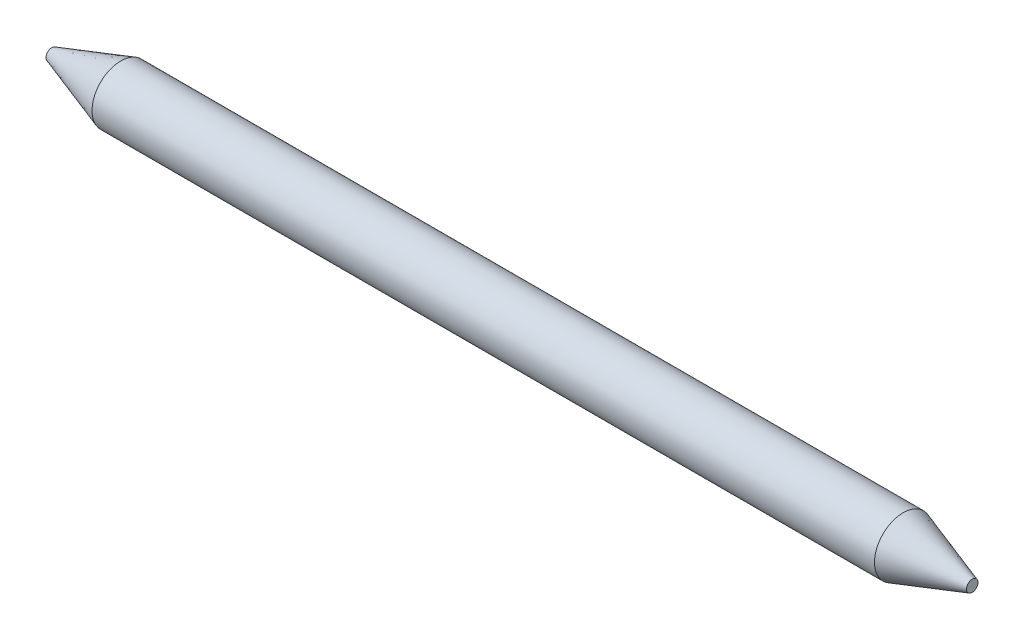
ISO-10303-21;
HEADER;
FILE_DESCRIPTION(('STEP AP214'),'2;1');
FILE_NAME('part.step','',(''),(''),'','','');
FILE_SCHEMA(('AUTOMOTIVE_DESIGN { 1 0 10303 214 1 1 1 1 }'));
ENDSEC;
DATA;
#1=APPLICATION_CONTEXT('core data for automotive mechanical design processes');
#2=APPLICATION_PROTOCOL_DEFINITION('international standard','automotive_design',2000,#1);
#3=PRODUCT_CONTEXT('',#1,'mechanical');
#4=PRODUCT('Part','Part','',(#3));
#5=PRODUCT_RELATED_PRODUCT_CATEGORY('part','',(#4));
#6=PRODUCT_DEFINITION_FORMATION('','',#4);
#7=PRODUCT_DEFINITION_CONTEXT('part definition',#1,'design');
#8=PRODUCT_DEFINITION('design','',#6,#7);
#9=PRODUCT_DEFINITION_SHAPE('','',#8);
#10=(LENGTH_UNIT() NAMED_UNIT(*) SI_UNIT(.MILLI.,.METRE.));
#11=(NAMED_UNIT(*) PLANE_ANGLE_UNIT() SI_UNIT($,.RADIAN.));
#12=(NAMED_UNIT(*) SI_UNIT($,.STERADIAN.) SOLID_ANGLE_UNIT());
#13=UNCERTAINTY_MEASURE_WITH_UNIT(LENGTH_MEASURE(1.E-05),#10,'distance_accuracy_value','');
#14=(GEOMETRIC_REPRESENTATION_CONTEXT(3) GLOBAL_UNCERTAINTY_ASSIGNED_CONTEXT((#13)) GLOBAL_UNIT_ASSIGNED_CONTEXT((#10,
#11,#12)) REPRESENTATION_CONTEXT('',''));
#15=CARTESIAN_POINT('',(0.,0.,0.));
#16=DIRECTION('',(0.,0.,1.));
#17=DIRECTION('',(1.,0.,0.));
#18=AXIS2_PLACEMENT_3D('',#15,#16,#17);
#19=CARTESIAN_POINT('',(25.4,0.,0.));
#20=DIRECTION('',(-1.,0.,0.));
#21=DIRECTION('',(0.,0.,1.));
#22=AXIS2_PLACEMENT_3D('',#19,#20,#21);
#23=CYLINDRICAL_SURFACE('',#22,1.5875);
#24=CARTESIAN_POINT('',(-21.59,0.,0.));
#25=DIRECTION('',(1.,0.,0.));
#26=DIRECTION('',(0.,0.,-1.));
#27=AXIS2_PLACEMENT_3D('',#24,#25,#26);
#28=CIRCLE('',#27,1.5875);
#29=CARTESIAN_POINT('',(-21.59,0.,-1.5875));
#30=VERTEX_POINT('',#29);
#31=EDGE_CURVE('E49',#30,#30,#28,.T.);
#32=ORIENTED_EDGE('',*,*,#31,.T.);
#33=EDGE_LOOP('',(#32));
#34=FACE_BOUND('',#33,.T.);
#35=CARTESIAN_POINT('',(21.59,0.,0.));
#36=DIRECTION('',(1.,0.,0.));
#37=DIRECTION('',(0.,0.,-1.));
#38=AXIS2_PLACEMENT_3D('',#35,#36,#37);
#39=CIRCLE('',#38,1.5875);
#40=CARTESIAN_POINT('',(21.59,0.,-1.5875));
#41=VERTEX_POINT('',#40);
#42=EDGE_CURVE('E53',#41,#41,#39,.F.);
#43=ORIENTED_EDGE('',*,*,#42,.T.);
#44=EDGE_LOOP('',(#43));
#45=FACE_BOUND('',#44,.T.);
#46=ADVANCED_FACE('F38',(#34,#45),#23,.T.);
#47=CARTESIAN_POINT('',(25.4,0.,0.));
#48=DIRECTION('',(1.,0.,0.));
#49=DIRECTION('',(0.,0.,-1.));
#50=AXIS2_PLACEMENT_3D('',#47,#48,#49);
#51=PLANE('',#50);
#52=CARTESIAN_POINT('',(25.4,0.,0.));
#53=DIRECTION('',(1.,0.,0.));
#54=DIRECTION('',(0.,0.,-1.));
#55=AXIS2_PLACEMENT_3D('',#52,#53,#54);
#56=CIRCLE('',#55,0.317500000000009);
#57=CARTESIAN_POINT('',(25.4,0.,-0.317500000000009));
#58=VERTEX_POINT('',#57);
#59=EDGE_CURVE('E10',#58,#58,#56,.T.);
#60=ORIENTED_EDGE('',*,*,#59,.T.);
#61=EDGE_LOOP('',(#60));
#62=FACE_BOUND('',#61,.T.);
#63=ADVANCED_FACE('F69',(#62),#51,.T.);
#64=CARTESIAN_POINT('',(-25.4,0.,0.));
#65=DIRECTION('',(1.,0.,0.));
#66=DIRECTION('',(0.,0.,-1.));
#67=AXIS2_PLACEMENT_3D('',#64,#65,#66);
#68=PLANE('',#67);
#69=CARTESIAN_POINT('',(-25.4,0.,0.));
#70=DIRECTION('',(1.,0.,0.));
#71=DIRECTION('',(0.,0.,-1.));
#72=AXIS2_PLACEMENT_3D('',#69,#70,#71);
#73=CIRCLE('',#72,0.317499999999999);
#74=CARTESIAN_POINT('',(-25.4,0.,-0.317499999999999));
#75=VERTEX_POINT('',#74);
#76=EDGE_CURVE('E45',#75,#75,#73,.F.);
#77=ORIENTED_EDGE('',*,*,#76,.T.);
#78=EDGE_LOOP('',(#77));
#79=FACE_BOUND('',#78,.T.);
#80=ADVANCED_FACE('F66',(#79),#68,.F.);
#81=CARTESIAN_POINT('',(-21.59,0.,0.));
#82=DIRECTION('',(1.,0.,0.));
#83=DIRECTION('',(0.,0.,-1.));
#84=AXIS2_PLACEMENT_3D('',#81,#82,#83);
#85=CONICAL_SURFACE('',#84,1.5875,0.321750554396642);
#86=ORIENTED_EDGE('',*,*,#76,.F.);
#87=EDGE_LOOP('',(#86));
#88=FACE_BOUND('',#87,.T.);
#89=ORIENTED_EDGE('',*,*,#31,.F.);
#90=EDGE_LOOP('',(#89));
#91=FACE_BOUND('',#90,.T.);
#92=ADVANCED_FACE('F62',(#88,#91),#85,.T.);
#93=CARTESIAN_POINT('',(25.4,0.,0.));
#94=DIRECTION('',(-1.,0.,0.));
#95=DIRECTION('',(0.,0.,1.));
#96=AXIS2_PLACEMENT_3D('',#93,#94,#95);
#97=CONICAL_SURFACE('',#96,0.317500000000009,0.321750554396639);
#98=ORIENTED_EDGE('',*,*,#42,.F.);
#99=EDGE_LOOP('',(#98));
#100=FACE_BOUND('',#99,.T.);
#101=ORIENTED_EDGE('',*,*,#59,.F.);
#102=EDGE_LOOP('',(#101));
#103=FACE_BOUND('',#102,.T.);
#104=ADVANCED_FACE('F40',(#100,#103),#97,.T.);
#105=CLOSED_SHELL('',(#46,#63,#80,#92,#104));
#106=MANIFOLD_SOLID_BREP('B2',#105);
#107=ADVANCED_BREP_SHAPE_REPRESENTATION('',(#18,#106),#14);
#108=SHAPE_DEFINITION_REPRESENTATION(#9,#107);
ENDSEC;
END-ISO-10303-21;
